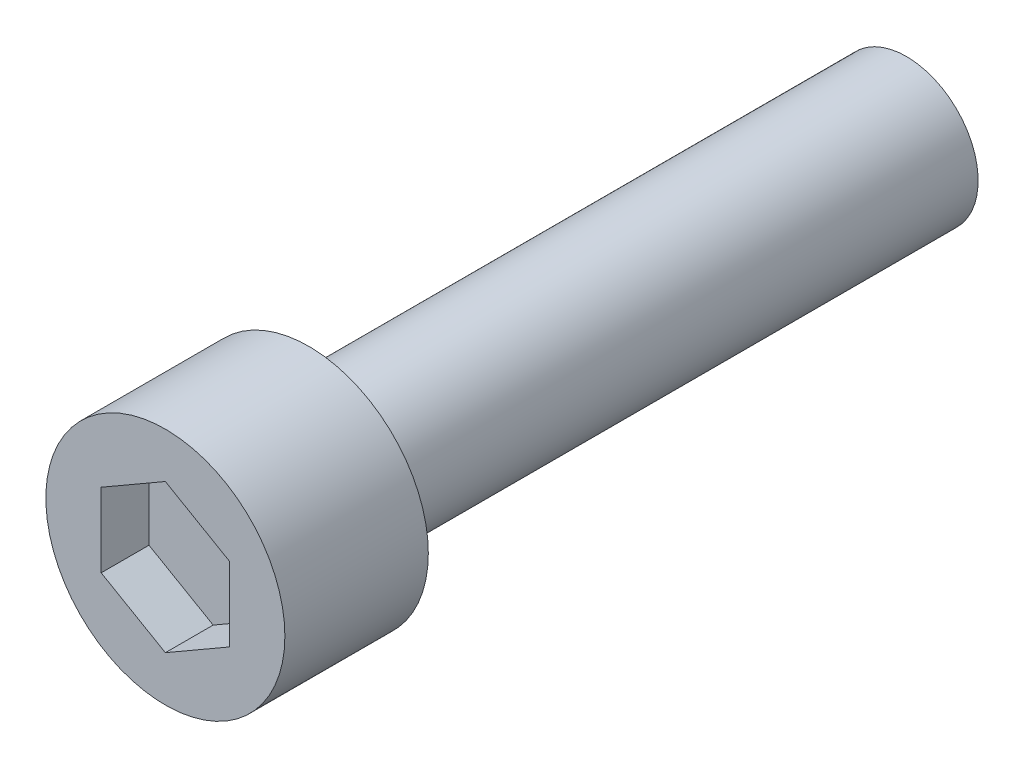
ISO-10303-21;
HEADER;
FILE_DESCRIPTION(('STEP AP214'),'2;1');
FILE_NAME('part.step','',(''),(''),'','','');
FILE_SCHEMA(('AUTOMOTIVE_DESIGN { 1 0 10303 214 1 1 1 1 }'));
ENDSEC;
DATA;
#1=APPLICATION_CONTEXT('core data for automotive mechanical design processes');
#2=APPLICATION_PROTOCOL_DEFINITION('international standard','automotive_design',2000,#1);
#3=PRODUCT_CONTEXT('',#1,'mechanical');
#4=PRODUCT('Part','Part','',(#3));
#5=PRODUCT_RELATED_PRODUCT_CATEGORY('part','',(#4));
#6=PRODUCT_DEFINITION_FORMATION('','',#4);
#7=PRODUCT_DEFINITION_CONTEXT('part definition',#1,'design');
#8=PRODUCT_DEFINITION('design','',#6,#7);
#9=PRODUCT_DEFINITION_SHAPE('','',#8);
#10=(LENGTH_UNIT() NAMED_UNIT(*) SI_UNIT(.MILLI.,.METRE.));
#11=(NAMED_UNIT(*) PLANE_ANGLE_UNIT() SI_UNIT($,.RADIAN.));
#12=(NAMED_UNIT(*) SI_UNIT($,.STERADIAN.) SOLID_ANGLE_UNIT());
#13=UNCERTAINTY_MEASURE_WITH_UNIT(LENGTH_MEASURE(1.E-05),#10,'distance_accuracy_value','');
#14=(GEOMETRIC_REPRESENTATION_CONTEXT(3) GLOBAL_UNCERTAINTY_ASSIGNED_CONTEXT((#13)) GLOBAL_UNIT_ASSIGNED_CONTEXT((#10,
#11,#12)) REPRESENTATION_CONTEXT('',''));
#15=CARTESIAN_POINT('',(0.,0.,0.));
#16=DIRECTION('',(0.,0.,1.));
#17=DIRECTION('',(1.,0.,0.));
#18=AXIS2_PLACEMENT_3D('',#15,#16,#17);
#19=CARTESIAN_POINT('',(0.,0.,4.));
#20=DIRECTION('',(0.,0.,1.));
#21=DIRECTION('',(1.,0.,0.));
#22=AXIS2_PLACEMENT_3D('',#19,#20,#21);
#23=PLANE('',#22);
#24=DIRECTION('',(0.866025403784439,0.5,0.));
#25=VECTOR('',#24,1.);
#26=CARTESIAN_POINT('',(2.68516980116154,-1.55028350752047,4.));
#27=LINE('',#26,#25);
#28=CARTESIAN_POINT('',(0.,-3.10056701504094,4.));
#29=VERTEX_POINT('',#28);
#30=CARTESIAN_POINT('',(2.68516980116154,-1.55028350752047,4.));
#31=VERTEX_POINT('',#30);
#32=EDGE_CURVE('E157',#29,#31,#27,.T.);
#33=ORIENTED_EDGE('',*,*,#32,.T.);
#34=DIRECTION('',(0.,1.,0.));
#35=VECTOR('',#34,1.);
#36=CARTESIAN_POINT('',(2.68516980116154,1.55028350752047,4.));
#37=LINE('',#36,#35);
#38=CARTESIAN_POINT('',(2.68516980116154,1.55028350752047,4.));
#39=VERTEX_POINT('',#38);
#40=EDGE_CURVE('E69',#31,#39,#37,.T.);
#41=ORIENTED_EDGE('',*,*,#40,.T.);
#42=DIRECTION('',(-0.866025403784439,0.5,0.));
#43=VECTOR('',#42,1.);
#44=CARTESIAN_POINT('',(0.,3.10056701504094,4.));
#45=LINE('',#44,#43);
#46=CARTESIAN_POINT('',(0.,3.10056701504094,4.));
#47=VERTEX_POINT('',#46);
#48=EDGE_CURVE('E71',#39,#47,#45,.T.);
#49=ORIENTED_EDGE('',*,*,#48,.T.);
#50=DIRECTION('',(-0.866025403784439,-0.5,0.));
#51=VECTOR('',#50,1.);
#52=CARTESIAN_POINT('',(-2.68516980116154,1.55028350752047,4.));
#53=LINE('',#52,#51);
#54=CARTESIAN_POINT('',(-2.68516980116154,1.55028350752047,4.));
#55=VERTEX_POINT('',#54);
#56=EDGE_CURVE('E73',#47,#55,#53,.T.);
#57=ORIENTED_EDGE('',*,*,#56,.T.);
#58=DIRECTION('',(0.,-1.,0.));
#59=VECTOR('',#58,1.);
#60=CARTESIAN_POINT('',(-2.68516980116154,-1.55028350752047,4.));
#61=LINE('',#60,#59);
#62=CARTESIAN_POINT('',(-2.68516980116154,-1.55028350752047,4.));
#63=VERTEX_POINT('',#62);
#64=EDGE_CURVE('E144',#55,#63,#61,.T.);
#65=ORIENTED_EDGE('',*,*,#64,.T.);
#66=DIRECTION('',(0.866025403784439,-0.5,0.));
#67=VECTOR('',#66,1.);
#68=CARTESIAN_POINT('',(0.,-3.10056701504094,4.));
#69=LINE('',#68,#67);
#70=EDGE_CURVE('E151',#63,#29,#69,.T.);
#71=ORIENTED_EDGE('',*,*,#70,.T.);
#72=EDGE_LOOP('',(#33,#41,#49,#57,#65,#71));
#73=FACE_BOUND('',#72,.T.);
#74=ADVANCED_FACE('F17',(#73),#23,.T.);
#75=CARTESIAN_POINT('',(-2.68516980116154,1.55028350752047,6.));
#76=DIRECTION('',(-0.5,0.866025403784439,0.));
#77=DIRECTION('',(-0.866025403784439,-0.5,0.));
#78=AXIS2_PLACEMENT_3D('',#75,#76,#77);
#79=PLANE('',#78);
#80=DIRECTION('',(0.,0.,1.));
#81=VECTOR('',#80,1.);
#82=CARTESIAN_POINT('',(-2.68516980116154,1.55028350752047,6.));
#83=LINE('',#82,#81);
#84=CARTESIAN_POINT('',(-2.68516980116154,1.55028350752047,6.));
#85=VERTEX_POINT('',#84);
#86=EDGE_CURVE('E85',#85,#55,#83,.F.);
#87=ORIENTED_EDGE('',*,*,#86,.T.);
#88=ORIENTED_EDGE('',*,*,#56,.F.);
#89=DIRECTION('',(0.,0.,1.));
#90=VECTOR('',#89,1.);
#91=CARTESIAN_POINT('',(0.,3.10056701504094,6.));
#92=LINE('',#91,#90);
#93=CARTESIAN_POINT('',(0.,3.10056701504094,6.));
#94=VERTEX_POINT('',#93);
#95=EDGE_CURVE('E79',#47,#94,#92,.T.);
#96=ORIENTED_EDGE('',*,*,#95,.T.);
#97=DIRECTION('',(0.866025403784438,0.5,0.));
#98=VECTOR('',#97,1.);
#99=CARTESIAN_POINT('',(-2.68516980116154,1.55028350752047,6.));
#100=LINE('',#99,#98);
#101=EDGE_CURVE('E141',#85,#94,#100,.T.);
#102=ORIENTED_EDGE('',*,*,#101,.F.);
#103=EDGE_LOOP('',(#87,#88,#96,#102));
#104=FACE_BOUND('',#103,.T.);
#105=ADVANCED_FACE('F82',(#104),#79,.F.);
#106=CARTESIAN_POINT('',(0.,3.10056701504094,6.));
#107=DIRECTION('',(0.5,0.866025403784439,0.));
#108=DIRECTION('',(-0.866025403784439,0.5,0.));
#109=AXIS2_PLACEMENT_3D('',#106,#107,#108);
#110=PLANE('',#109);
#111=ORIENTED_EDGE('',*,*,#95,.F.);
#112=ORIENTED_EDGE('',*,*,#48,.F.);
#113=DIRECTION('',(0.,0.,-1.));
#114=VECTOR('',#113,1.);
#115=CARTESIAN_POINT('',(2.68516980116154,1.55028350752047,6.));
#116=LINE('',#115,#114);
#117=CARTESIAN_POINT('',(2.68516980116154,1.55028350752047,6.));
#118=VERTEX_POINT('',#117);
#119=EDGE_CURVE('E99',#39,#118,#116,.F.);
#120=ORIENTED_EDGE('',*,*,#119,.T.);
#121=DIRECTION('',(0.866025403784438,-0.5,0.));
#122=VECTOR('',#121,1.);
#123=CARTESIAN_POINT('',(0.,3.10056701504094,6.));
#124=LINE('',#123,#122);
#125=EDGE_CURVE('E91',#94,#118,#124,.T.);
#126=ORIENTED_EDGE('',*,*,#125,.F.);
#127=EDGE_LOOP('',(#111,#112,#120,#126));
#128=FACE_BOUND('',#127,.T.);
#129=ADVANCED_FACE('F89',(#128),#110,.F.);
#130=CARTESIAN_POINT('',(2.68516980116154,1.55028350752047,6.));
#131=DIRECTION('',(1.,0.,0.));
#132=DIRECTION('',(0.,0.,-1.));
#133=AXIS2_PLACEMENT_3D('',#130,#131,#132);
#134=PLANE('',#133);
#135=ORIENTED_EDGE('',*,*,#119,.F.);
#136=ORIENTED_EDGE('',*,*,#40,.F.);
#137=DIRECTION('',(0.,0.,1.));
#138=VECTOR('',#137,1.);
#139=CARTESIAN_POINT('',(2.68516980116154,-1.55028350752047,6.));
#140=LINE('',#139,#138);
#141=CARTESIAN_POINT('',(2.68516980116154,-1.55028350752047,6.));
#142=VERTEX_POINT('',#141);
#143=EDGE_CURVE('E154',#31,#142,#140,.T.);
#144=ORIENTED_EDGE('',*,*,#143,.T.);
#145=DIRECTION('',(0.,1.,0.));
#146=VECTOR('',#145,1.);
#147=CARTESIAN_POINT('',(2.68516980116154,0.,6.));
#148=LINE('',#147,#146);
#149=EDGE_CURVE('E135',#118,#142,#148,.F.);
#150=ORIENTED_EDGE('',*,*,#149,.F.);
#151=EDGE_LOOP('',(#135,#136,#144,#150));
#152=FACE_BOUND('',#151,.T.);
#153=ADVANCED_FACE('F162',(#152),#134,.F.);
#154=CARTESIAN_POINT('',(2.68516980116154,-1.55028350752047,6.));
#155=DIRECTION('',(0.5,-0.866025403784439,0.));
#156=DIRECTION('',(0.866025403784439,0.5,0.));
#157=AXIS2_PLACEMENT_3D('',#154,#155,#156);
#158=PLANE('',#157);
#159=ORIENTED_EDGE('',*,*,#143,.F.);
#160=ORIENTED_EDGE('',*,*,#32,.F.);
#161=DIRECTION('',(0.,0.,1.));
#162=VECTOR('',#161,1.);
#163=CARTESIAN_POINT('',(0.,-3.10056701504094,6.));
#164=LINE('',#163,#162);
#165=CARTESIAN_POINT('',(0.,-3.10056701504094,6.));
#166=VERTEX_POINT('',#165);
#167=EDGE_CURVE('E148',#29,#166,#164,.T.);
#168=ORIENTED_EDGE('',*,*,#167,.T.);
#169=DIRECTION('',(-0.866025403784438,-0.5,0.));
#170=VECTOR('',#169,1.);
#171=CARTESIAN_POINT('',(2.68516980116154,-1.55028350752047,6.));
#172=LINE('',#171,#170);
#173=EDGE_CURVE('E130',#142,#166,#172,.T.);
#174=ORIENTED_EDGE('',*,*,#173,.F.);
#175=EDGE_LOOP('',(#159,#160,#168,#174));
#176=FACE_BOUND('',#175,.T.);
#177=ADVANCED_FACE('F173',(#176),#158,.F.);
#178=CARTESIAN_POINT('',(0.,-3.10056701504094,6.));
#179=DIRECTION('',(-0.5,-0.866025403784439,0.));
#180=DIRECTION('',(0.866025403784439,-0.5,0.));
#181=AXIS2_PLACEMENT_3D('',#178,#179,#180);
#182=PLANE('',#181);
#183=ORIENTED_EDGE('',*,*,#167,.F.);
#184=ORIENTED_EDGE('',*,*,#70,.F.);
#185=DIRECTION('',(0.,0.,1.));
#186=VECTOR('',#185,1.);
#187=CARTESIAN_POINT('',(-2.68516980116154,-1.55028350752047,6.));
#188=LINE('',#187,#186);
#189=CARTESIAN_POINT('',(-2.68516980116154,-1.55028350752047,6.));
#190=VERTEX_POINT('',#189);
#191=EDGE_CURVE('E36',#63,#190,#188,.T.);
#192=ORIENTED_EDGE('',*,*,#191,.T.);
#193=DIRECTION('',(-0.866025403784438,0.5,0.));
#194=VECTOR('',#193,1.);
#195=CARTESIAN_POINT('',(0.,-3.10056701504094,6.));
#196=LINE('',#195,#194);
#197=EDGE_CURVE('E124',#166,#190,#196,.T.);
#198=ORIENTED_EDGE('',*,*,#197,.F.);
#199=EDGE_LOOP('',(#183,#184,#192,#198));
#200=FACE_BOUND('',#199,.T.);
#201=ADVANCED_FACE('F171',(#200),#182,.F.);
#202=CARTESIAN_POINT('',(-2.68516980116154,-1.55028350752047,6.));
#203=DIRECTION('',(-1.,0.,0.));
#204=DIRECTION('',(0.,-1.,0.));
#205=AXIS2_PLACEMENT_3D('',#202,#203,#204);
#206=PLANE('',#205);
#207=ORIENTED_EDGE('',*,*,#191,.F.);
#208=ORIENTED_EDGE('',*,*,#64,.F.);
#209=ORIENTED_EDGE('',*,*,#86,.F.);
#210=DIRECTION('',(0.,1.,0.));
#211=VECTOR('',#210,1.);
#212=CARTESIAN_POINT('',(-2.68516980116154,0.,6.));
#213=LINE('',#212,#211);
#214=EDGE_CURVE('E118',#190,#85,#213,.T.);
#215=ORIENTED_EDGE('',*,*,#214,.F.);
#216=EDGE_LOOP('',(#207,#208,#209,#215));
#217=FACE_BOUND('',#216,.T.);
#218=ADVANCED_FACE('F168',(#217),#206,.F.);
#219=CARTESIAN_POINT('',(0.,0.,6.));
#220=DIRECTION('',(0.,0.,1.));
#221=DIRECTION('',(1.,0.,0.));
#222=AXIS2_PLACEMENT_3D('',#219,#220,#221);
#223=PLANE('',#222);
#224=ORIENTED_EDGE('',*,*,#197,.T.);
#225=ORIENTED_EDGE('',*,*,#214,.T.);
#226=ORIENTED_EDGE('',*,*,#101,.T.);
#227=ORIENTED_EDGE('',*,*,#125,.T.);
#228=ORIENTED_EDGE('',*,*,#149,.T.);
#229=ORIENTED_EDGE('',*,*,#173,.T.);
#230=EDGE_LOOP('',(#224,#225,#226,#227,#228,#229));
#231=FACE_BOUND('',#230,.T.);
#232=CARTESIAN_POINT('',(0.,0.,6.));
#233=DIRECTION('',(0.,0.,1.));
#234=DIRECTION('',(1.,0.,0.));
#235=AXIS2_PLACEMENT_3D('',#232,#233,#234);
#236=CIRCLE('',#235,5.);
#237=CARTESIAN_POINT('',(5.,0.,6.));
#238=VERTEX_POINT('',#237);
#239=EDGE_CURVE('E114',#238,#238,#236,.F.);
#240=ORIENTED_EDGE('',*,*,#239,.F.);
#241=EDGE_LOOP('',(#240));
#242=FACE_BOUND('',#241,.T.);
#243=ADVANCED_FACE('F165',(#231,#242),#223,.T.);
#244=CARTESIAN_POINT('',(0.,0.,0.));
#245=DIRECTION('',(0.,0.,1.));
#246=DIRECTION('',(1.,0.,0.));
#247=AXIS2_PLACEMENT_3D('',#244,#245,#246);
#248=CYLINDRICAL_SURFACE('',#247,5.);
#249=CARTESIAN_POINT('',(0.,0.,0.));
#250=DIRECTION('',(0.,0.,1.));
#251=DIRECTION('',(1.,0.,0.));
#252=AXIS2_PLACEMENT_3D('',#249,#250,#251);
#253=CIRCLE('',#252,5.);
#254=CARTESIAN_POINT('',(5.,0.,0.));
#255=VERTEX_POINT('',#254);
#256=EDGE_CURVE('E108',#255,#255,#253,.T.);
#257=ORIENTED_EDGE('',*,*,#256,.T.);
#258=EDGE_LOOP('',(#257));
#259=FACE_BOUND('',#258,.T.);
#260=ORIENTED_EDGE('',*,*,#239,.T.);
#261=EDGE_LOOP('',(#260));
#262=FACE_BOUND('',#261,.T.);
#263=ADVANCED_FACE('F198',(#259,#262),#248,.T.);
#264=CARTESIAN_POINT('',(0.,0.,-25.));
#265=DIRECTION('',(0.,0.,1.));
#266=DIRECTION('',(1.,0.,0.));
#267=AXIS2_PLACEMENT_3D('',#264,#265,#266);
#268=PLANE('',#267);
#269=CARTESIAN_POINT('',(0.,0.,-25.));
#270=DIRECTION('',(0.,0.,-1.));
#271=DIRECTION('',(-1.,0.,0.));
#272=AXIS2_PLACEMENT_3D('',#269,#270,#271);
#273=CIRCLE('',#272,3.);
#274=CARTESIAN_POINT('',(-3.,0.,-25.));
#275=VERTEX_POINT('',#274);
#276=EDGE_CURVE('E27',#275,#275,#273,.F.);
#277=ORIENTED_EDGE('',*,*,#276,.F.);
#278=EDGE_LOOP('',(#277));
#279=FACE_BOUND('',#278,.T.);
#280=ADVANCED_FACE('F191',(#279),#268,.F.);
#281=CARTESIAN_POINT('',(0.,0.,0.));
#282=DIRECTION('',(0.,0.,1.));
#283=DIRECTION('',(1.,0.,0.));
#284=AXIS2_PLACEMENT_3D('',#281,#282,#283);
#285=PLANE('',#284);
#286=CARTESIAN_POINT('',(0.,0.,0.));
#287=DIRECTION('',(0.,0.,-1.));
#288=DIRECTION('',(-1.,0.,0.));
#289=AXIS2_PLACEMENT_3D('',#286,#287,#288);
#290=CIRCLE('',#289,3.);
#291=CARTESIAN_POINT('',(-3.,0.,0.));
#292=VERTEX_POINT('',#291);
#293=EDGE_CURVE('E11',#292,#292,#290,.T.);
#294=ORIENTED_EDGE('',*,*,#293,.F.);
#295=EDGE_LOOP('',(#294));
#296=FACE_BOUND('',#295,.T.);
#297=ORIENTED_EDGE('',*,*,#256,.F.);
#298=EDGE_LOOP('',(#297));
#299=FACE_BOUND('',#298,.T.);
#300=ADVANCED_FACE('F185',(#296,#299),#285,.F.);
#301=CARTESIAN_POINT('',(0.,0.,0.));
#302=DIRECTION('',(0.,0.,-1.));
#303=DIRECTION('',(-1.,0.,0.));
#304=AXIS2_PLACEMENT_3D('',#301,#302,#303);
#305=CYLINDRICAL_SURFACE('',#304,3.);
#306=ORIENTED_EDGE('',*,*,#293,.T.);
#307=EDGE_LOOP('',(#306));
#308=FACE_BOUND('',#307,.T.);
#309=ORIENTED_EDGE('',*,*,#276,.T.);
#310=EDGE_LOOP('',(#309));
#311=FACE_BOUND('',#310,.T.);
#312=ADVANCED_FACE('F183',(#308,#311),#305,.T.);
#313=CLOSED_SHELL('',(#74,#105,#129,#153,#177,#201,#218,#243,#263,#280,#300,#312));
#314=MANIFOLD_SOLID_BREP('B1',#313);
#315=ADVANCED_BREP_SHAPE_REPRESENTATION('',(#18,#314),#14);
#316=SHAPE_DEFINITION_REPRESENTATION(#9,#315);
ENDSEC;
END-ISO-10303-21;
